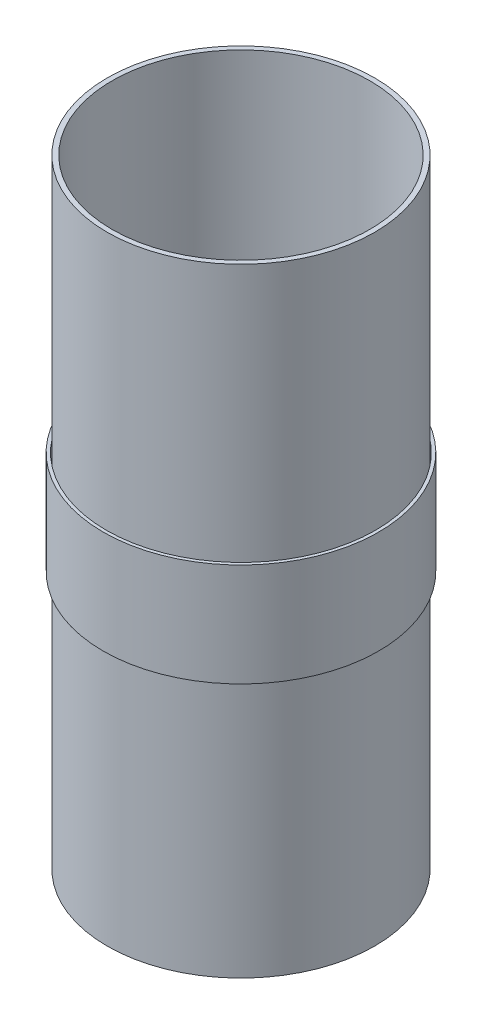
ISO-10303-21;
HEADER;
FILE_DESCRIPTION(('STEP AP214'),'2;1');
FILE_NAME('part.step','',(''),(''),'','','');
FILE_SCHEMA(('AUTOMOTIVE_DESIGN { 1 0 10303 214 1 1 1 1 }'));
ENDSEC;
DATA;
#1=APPLICATION_CONTEXT('core data for automotive mechanical design processes');
#2=APPLICATION_PROTOCOL_DEFINITION('international standard','automotive_design',2000,#1);
#3=PRODUCT_CONTEXT('',#1,'mechanical');
#4=PRODUCT('Part','Part','',(#3));
#5=PRODUCT_RELATED_PRODUCT_CATEGORY('part','',(#4));
#6=PRODUCT_DEFINITION_FORMATION('','',#4);
#7=PRODUCT_DEFINITION_CONTEXT('part definition',#1,'design');
#8=PRODUCT_DEFINITION('design','',#6,#7);
#9=PRODUCT_DEFINITION_SHAPE('','',#8);
#10=(LENGTH_UNIT() NAMED_UNIT(*) SI_UNIT(.MILLI.,.METRE.));
#11=(NAMED_UNIT(*) PLANE_ANGLE_UNIT() SI_UNIT($,.RADIAN.));
#12=(NAMED_UNIT(*) SI_UNIT($,.STERADIAN.) SOLID_ANGLE_UNIT());
#13=UNCERTAINTY_MEASURE_WITH_UNIT(LENGTH_MEASURE(1.E-05),#10,'distance_accuracy_value','');
#14=(GEOMETRIC_REPRESENTATION_CONTEXT(3) GLOBAL_UNCERTAINTY_ASSIGNED_CONTEXT((#13)) GLOBAL_UNIT_ASSIGNED_CONTEXT((#10,
#11,#12)) REPRESENTATION_CONTEXT('',''));
#15=CARTESIAN_POINT('',(0.,0.,0.));
#16=DIRECTION('',(0.,0.,1.));
#17=DIRECTION('',(1.,0.,0.));
#18=AXIS2_PLACEMENT_3D('',#15,#16,#17);
#19=CARTESIAN_POINT('',(0.,133.35,0.));
#20=DIRECTION('',(0.,1.,0.));
#21=DIRECTION('',(0.,0.,1.));
#22=AXIS2_PLACEMENT_3D('',#19,#20,#21);
#23=PLANE('',#22);
#24=CARTESIAN_POINT('',(0.,133.35,0.));
#25=DIRECTION('',(0.,1.,0.));
#26=DIRECTION('',(0.,0.,1.));
#27=AXIS2_PLACEMENT_3D('',#24,#25,#26);
#28=CIRCLE('',#27,50.9524);
#29=CARTESIAN_POINT('',(0.,133.35,50.9524));
#30=VERTEX_POINT('',#29);
#31=EDGE_CURVE('E11',#30,#30,#28,.T.);
#32=ORIENTED_EDGE('',*,*,#31,.T.);
#33=EDGE_LOOP('',(#32));
#34=FACE_BOUND('',#33,.T.);
#35=CARTESIAN_POINT('',(0.,133.35,0.));
#36=DIRECTION('',(0.,1.,0.));
#37=DIRECTION('',(0.,0.,1.));
#38=AXIS2_PLACEMENT_3D('',#35,#36,#37);
#39=CIRCLE('',#38,49.7967);
#40=CARTESIAN_POINT('',(0.,133.35,49.7967));
#41=VERTEX_POINT('',#40);
#42=EDGE_CURVE('E54',#41,#41,#39,.T.);
#43=ORIENTED_EDGE('',*,*,#42,.F.);
#44=EDGE_LOOP('',(#43));
#45=FACE_BOUND('',#44,.T.);
#46=ADVANCED_FACE('F43',(#34,#45),#23,.T.);
#47=CARTESIAN_POINT('',(0.,95.25,0.));
#48=DIRECTION('',(0.,1.,0.));
#49=DIRECTION('',(0.,0.,1.));
#50=AXIS2_PLACEMENT_3D('',#47,#48,#49);
#51=PLANE('',#50);
#52=CARTESIAN_POINT('',(0.,95.25,0.));
#53=DIRECTION('',(0.,1.,0.));
#54=DIRECTION('',(0.,0.,1.));
#55=AXIS2_PLACEMENT_3D('',#52,#53,#54);
#56=CIRCLE('',#55,50.9524);
#57=CARTESIAN_POINT('',(0.,95.25,50.9524));
#58=VERTEX_POINT('',#57);
#59=EDGE_CURVE('E47',#58,#58,#56,.T.);
#60=ORIENTED_EDGE('',*,*,#59,.F.);
#61=EDGE_LOOP('',(#60));
#62=FACE_BOUND('',#61,.T.);
#63=CARTESIAN_POINT('',(0.,95.25,0.));
#64=DIRECTION('',(0.,1.,0.));
#65=DIRECTION('',(0.,0.,1.));
#66=AXIS2_PLACEMENT_3D('',#63,#64,#65);
#67=CIRCLE('',#66,49.7967);
#68=CARTESIAN_POINT('',(0.,95.25,49.7967));
#69=VERTEX_POINT('',#68);
#70=EDGE_CURVE('E56',#69,#69,#67,.T.);
#71=ORIENTED_EDGE('',*,*,#70,.T.);
#72=EDGE_LOOP('',(#71));
#73=FACE_BOUND('',#72,.T.);
#74=ADVANCED_FACE('F66',(#62,#73),#51,.F.);
#75=CARTESIAN_POINT('',(0.,133.35,0.));
#76=DIRECTION('',(0.,-1.,0.));
#77=DIRECTION('',(0.,0.,-1.));
#78=AXIS2_PLACEMENT_3D('',#75,#76,#77);
#79=CYLINDRICAL_SURFACE('',#78,50.9524);
#80=ORIENTED_EDGE('',*,*,#31,.F.);
#81=EDGE_LOOP('',(#80));
#82=FACE_BOUND('',#81,.T.);
#83=ORIENTED_EDGE('',*,*,#59,.T.);
#84=EDGE_LOOP('',(#83));
#85=FACE_BOUND('',#84,.T.);
#86=ADVANCED_FACE('F45',(#82,#85),#79,.T.);
#87=CARTESIAN_POINT('',(0.,133.35,0.));
#88=DIRECTION('',(0.,-1.,0.));
#89=DIRECTION('',(0.,0.,-1.));
#90=AXIS2_PLACEMENT_3D('',#87,#88,#89);
#91=CYLINDRICAL_SURFACE('',#90,49.7967);
#92=ORIENTED_EDGE('',*,*,#42,.T.);
#93=EDGE_LOOP('',(#92));
#94=FACE_BOUND('',#93,.T.);
#95=ORIENTED_EDGE('',*,*,#70,.F.);
#96=EDGE_LOOP('',(#95));
#97=FACE_BOUND('',#96,.T.);
#98=ADVANCED_FACE('F62',(#94,#97),#91,.F.);
#99=CLOSED_SHELL('',(#46,#74,#86,#98));
#100=MANIFOLD_SOLID_BREP('B2',#99);
#101=CARTESIAN_POINT('',(0.,228.6,0.));
#102=DIRECTION('',(0.,1.,0.));
#103=DIRECTION('',(0.,0.,1.));
#104=AXIS2_PLACEMENT_3D('',#101,#102,#103);
#105=PLANE('',#104);
#106=CARTESIAN_POINT('',(0.,228.6,0.));
#107=DIRECTION('',(0.,1.,0.));
#108=DIRECTION('',(0.,0.,1.));
#109=AXIS2_PLACEMENT_3D('',#106,#107,#108);
#110=CIRCLE('',#109,49.4538);
#111=CARTESIAN_POINT('',(0.,228.6,49.4538));
#112=VERTEX_POINT('',#111);
#113=EDGE_CURVE('E42',#112,#112,#110,.T.);
#114=ORIENTED_EDGE('',*,*,#113,.T.);
#115=EDGE_LOOP('',(#114));
#116=FACE_BOUND('',#115,.T.);
#117=CARTESIAN_POINT('',(0.,228.6,0.));
#118=DIRECTION('',(0.,1.,0.));
#119=DIRECTION('',(0.,0.,1.));
#120=AXIS2_PLACEMENT_3D('',#117,#118,#119);
#121=CIRCLE('',#120,47.6504);
#122=CARTESIAN_POINT('',(0.,228.6,47.6504));
#123=VERTEX_POINT('',#122);
#124=EDGE_CURVE('E124',#123,#123,#121,.T.);
#125=ORIENTED_EDGE('',*,*,#124,.F.);
#126=EDGE_LOOP('',(#125));
#127=FACE_BOUND('',#126,.T.);
#128=ADVANCED_FACE('F113',(#116,#127),#105,.T.);
#129=CARTESIAN_POINT('',(0.,0.,0.));
#130=DIRECTION('',(0.,1.,0.));
#131=DIRECTION('',(0.,0.,1.));
#132=AXIS2_PLACEMENT_3D('',#129,#130,#131);
#133=PLANE('',#132);
#134=CARTESIAN_POINT('',(0.,0.,0.));
#135=DIRECTION('',(0.,1.,0.));
#136=DIRECTION('',(0.,0.,1.));
#137=AXIS2_PLACEMENT_3D('',#134,#135,#136);
#138=CIRCLE('',#137,49.4538);
#139=CARTESIAN_POINT('',(0.,0.,49.4538));
#140=VERTEX_POINT('',#139);
#141=EDGE_CURVE('E117',#140,#140,#138,.T.);
#142=ORIENTED_EDGE('',*,*,#141,.F.);
#143=EDGE_LOOP('',(#142));
#144=FACE_BOUND('',#143,.T.);
#145=CARTESIAN_POINT('',(0.,0.,0.));
#146=DIRECTION('',(0.,1.,0.));
#147=DIRECTION('',(0.,0.,1.));
#148=AXIS2_PLACEMENT_3D('',#145,#146,#147);
#149=CIRCLE('',#148,47.6504);
#150=CARTESIAN_POINT('',(0.,0.,47.6504));
#151=VERTEX_POINT('',#150);
#152=EDGE_CURVE('E126',#151,#151,#149,.T.);
#153=ORIENTED_EDGE('',*,*,#152,.T.);
#154=EDGE_LOOP('',(#153));
#155=FACE_BOUND('',#154,.T.);
#156=ADVANCED_FACE('F136',(#144,#155),#133,.F.);
#157=CARTESIAN_POINT('',(0.,228.6,0.));
#158=DIRECTION('',(0.,-1.,0.));
#159=DIRECTION('',(0.,0.,-1.));
#160=AXIS2_PLACEMENT_3D('',#157,#158,#159);
#161=CYLINDRICAL_SURFACE('',#160,49.4538);
#162=ORIENTED_EDGE('',*,*,#113,.F.);
#163=EDGE_LOOP('',(#162));
#164=FACE_BOUND('',#163,.T.);
#165=ORIENTED_EDGE('',*,*,#141,.T.);
#166=EDGE_LOOP('',(#165));
#167=FACE_BOUND('',#166,.T.);
#168=ADVANCED_FACE('F115',(#164,#167),#161,.T.);
#169=CARTESIAN_POINT('',(0.,228.6,0.));
#170=DIRECTION('',(0.,-1.,0.));
#171=DIRECTION('',(0.,0.,-1.));
#172=AXIS2_PLACEMENT_3D('',#169,#170,#171);
#173=CYLINDRICAL_SURFACE('',#172,47.6504);
#174=ORIENTED_EDGE('',*,*,#124,.T.);
#175=EDGE_LOOP('',(#174));
#176=FACE_BOUND('',#175,.T.);
#177=ORIENTED_EDGE('',*,*,#152,.F.);
#178=EDGE_LOOP('',(#177));
#179=FACE_BOUND('',#178,.T.);
#180=ADVANCED_FACE('F132',(#176,#179),#173,.F.);
#181=CLOSED_SHELL('',(#128,#156,#168,#180));
#182=MANIFOLD_SOLID_BREP('B6',#181);
#183=ADVANCED_BREP_SHAPE_REPRESENTATION('',(#18,#100,#182),#14);
#184=SHAPE_DEFINITION_REPRESENTATION(#9,#183);
ENDSEC;
END-ISO-10303-21;
